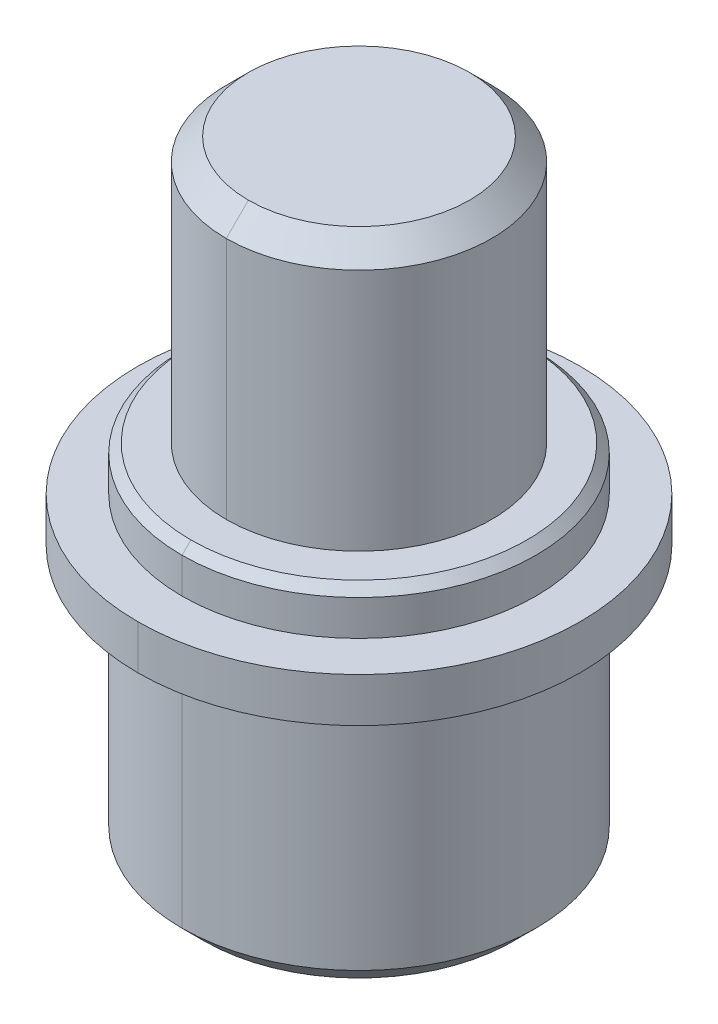
ISO-10303-21;
HEADER;
FILE_DESCRIPTION(('STEP AP214'),'2;1');
FILE_NAME('part.step','',(''),(''),'','','');
FILE_SCHEMA(('AUTOMOTIVE_DESIGN { 1 0 10303 214 1 1 1 1 }'));
ENDSEC;
DATA;
#1=APPLICATION_CONTEXT('core data for automotive mechanical design processes');
#2=APPLICATION_PROTOCOL_DEFINITION('international standard','automotive_design',2000,#1);
#3=PRODUCT_CONTEXT('',#1,'mechanical');
#4=PRODUCT('Part','Part','',(#3));
#5=PRODUCT_RELATED_PRODUCT_CATEGORY('part','',(#4));
#6=PRODUCT_DEFINITION_FORMATION('','',#4);
#7=PRODUCT_DEFINITION_CONTEXT('part definition',#1,'design');
#8=PRODUCT_DEFINITION('design','',#6,#7);
#9=PRODUCT_DEFINITION_SHAPE('','',#8);
#10=(LENGTH_UNIT() NAMED_UNIT(*) SI_UNIT(.MILLI.,.METRE.));
#11=(NAMED_UNIT(*) PLANE_ANGLE_UNIT() SI_UNIT($,.RADIAN.));
#12=(NAMED_UNIT(*) SI_UNIT($,.STERADIAN.) SOLID_ANGLE_UNIT());
#13=UNCERTAINTY_MEASURE_WITH_UNIT(LENGTH_MEASURE(1.E-05),#10,'distance_accuracy_value','');
#14=(GEOMETRIC_REPRESENTATION_CONTEXT(3) GLOBAL_UNCERTAINTY_ASSIGNED_CONTEXT((#13)) GLOBAL_UNIT_ASSIGNED_CONTEXT((#10,
#11,#12)) REPRESENTATION_CONTEXT('',''));
#15=CARTESIAN_POINT('',(0.,0.,0.));
#16=DIRECTION('',(0.,0.,1.));
#17=DIRECTION('',(1.,0.,0.));
#18=AXIS2_PLACEMENT_3D('',#15,#16,#17);
#19=CARTESIAN_POINT('',(0.,8.,0.));
#20=DIRECTION('',(0.,-1.,0.));
#21=DIRECTION('',(0.,0.,-1.));
#22=AXIS2_PLACEMENT_3D('',#19,#20,#21);
#23=CONICAL_SURFACE('',#22,3.8,0.785398163397438);
#24=CARTESIAN_POINT('',(0.,8.,0.));
#25=DIRECTION('',(0.,1.,0.));
#26=DIRECTION('',(0.,0.,1.));
#27=AXIS2_PLACEMENT_3D('',#24,#25,#26);
#28=CIRCLE('',#27,3.8);
#29=CARTESIAN_POINT('',(0.,8.,3.8));
#30=VERTEX_POINT('',#29);
#31=CARTESIAN_POINT('',(0.,8.,-3.8));
#32=VERTEX_POINT('',#31);
#33=EDGE_CURVE('E41',#30,#32,#28,.T.);
#34=ORIENTED_EDGE('',*,*,#33,.F.);
#35=DIRECTION('',(0.,-0.707106781186555,0.70710678118654));
#36=VECTOR('',#35,1.);
#37=CARTESIAN_POINT('',(0.,8.,3.8));
#38=LINE('',#37,#36);
#39=CARTESIAN_POINT('',(0.,7.8,4.));
#40=VERTEX_POINT('',#39);
#41=EDGE_CURVE('E11',#30,#40,#38,.T.);
#42=ORIENTED_EDGE('',*,*,#41,.T.);
#43=CARTESIAN_POINT('',(0.,7.8,0.));
#44=DIRECTION('',(0.,-1.,0.));
#45=DIRECTION('',(0.,0.,1.));
#46=AXIS2_PLACEMENT_3D('',#43,#44,#45);
#47=CIRCLE('',#46,4.);
#48=CARTESIAN_POINT('',(0.,7.8,-4.));
#49=VERTEX_POINT('',#48);
#50=EDGE_CURVE('E132',#49,#40,#47,.T.);
#51=ORIENTED_EDGE('',*,*,#50,.F.);
#52=DIRECTION('',(0.,-0.707106781186555,-0.70710678118654));
#53=VECTOR('',#52,1.);
#54=CARTESIAN_POINT('',(0.,8.,-3.8));
#55=LINE('',#54,#53);
#56=EDGE_CURVE('E176',#32,#49,#55,.T.);
#57=ORIENTED_EDGE('',*,*,#56,.F.);
#58=EDGE_LOOP('',(#34,#42,#51,#57));
#59=FACE_BOUND('',#58,.T.);
#60=ADVANCED_FACE('F16',(#59),#23,.T.);
#61=CARTESIAN_POINT('',(0.,14.,0.));
#62=DIRECTION('',(0.,-1.,0.));
#63=DIRECTION('',(0.,0.,-1.));
#64=AXIS2_PLACEMENT_3D('',#61,#62,#63);
#65=CONICAL_SURFACE('',#64,2.5,0.785398163397445);
#66=CARTESIAN_POINT('',(0.,14.,0.));
#67=DIRECTION('',(0.,1.,0.));
#68=DIRECTION('',(0.,0.,1.));
#69=AXIS2_PLACEMENT_3D('',#66,#67,#68);
#70=CIRCLE('',#69,2.5);
#71=CARTESIAN_POINT('',(0.,14.,2.5));
#72=VERTEX_POINT('',#71);
#73=CARTESIAN_POINT('',(0.,14.,-2.5));
#74=VERTEX_POINT('',#73);
#75=EDGE_CURVE('E224',#72,#74,#70,.T.);
#76=ORIENTED_EDGE('',*,*,#75,.F.);
#77=DIRECTION('',(0.,-0.70710678118655,0.707106781186545));
#78=VECTOR('',#77,1.);
#79=CARTESIAN_POINT('',(0.,14.,2.5));
#80=LINE('',#79,#78);
#81=CARTESIAN_POINT('',(0.,13.5,3.));
#82=VERTEX_POINT('',#81);
#83=EDGE_CURVE('E27',#72,#82,#80,.T.);
#84=ORIENTED_EDGE('',*,*,#83,.T.);
#85=CARTESIAN_POINT('',(0.,13.5,0.));
#86=DIRECTION('',(0.,-1.,0.));
#87=DIRECTION('',(0.,0.,1.));
#88=AXIS2_PLACEMENT_3D('',#85,#86,#87);
#89=CIRCLE('',#88,3.);
#90=CARTESIAN_POINT('',(0.,13.5,-3.));
#91=VERTEX_POINT('',#90);
#92=EDGE_CURVE('E189',#91,#82,#89,.T.);
#93=ORIENTED_EDGE('',*,*,#92,.F.);
#94=DIRECTION('',(0.,-0.70710678118655,-0.707106781186545));
#95=VECTOR('',#94,1.);
#96=CARTESIAN_POINT('',(0.,14.,-2.5));
#97=LINE('',#96,#95);
#98=EDGE_CURVE('E172',#74,#91,#97,.T.);
#99=ORIENTED_EDGE('',*,*,#98,.F.);
#100=EDGE_LOOP('',(#76,#84,#93,#99));
#101=FACE_BOUND('',#100,.T.);
#102=ADVANCED_FACE('F293',(#101),#65,.T.);
#103=CARTESIAN_POINT('',(0.,0.5,0.));
#104=DIRECTION('',(0.,1.,0.));
#105=DIRECTION('',(0.,0.,1.));
#106=AXIS2_PLACEMENT_3D('',#103,#104,#105);
#107=CONICAL_SURFACE('',#106,4.,0.78539816339745);
#108=CARTESIAN_POINT('',(0.,0.,0.));
#109=DIRECTION('',(0.,-1.,0.));
#110=DIRECTION('',(0.,0.,-1.));
#111=AXIS2_PLACEMENT_3D('',#108,#109,#110);
#112=CIRCLE('',#111,3.5);
#113=CARTESIAN_POINT('',(0.,0.,-3.5));
#114=VERTEX_POINT('',#113);
#115=CARTESIAN_POINT('',(0.,0.,3.5));
#116=VERTEX_POINT('',#115);
#117=EDGE_CURVE('E157',#114,#116,#112,.T.);
#118=ORIENTED_EDGE('',*,*,#117,.F.);
#119=DIRECTION('',(0.,0.707106781186546,-0.707106781186549));
#120=VECTOR('',#119,1.);
#121=CARTESIAN_POINT('',(0.,0.5,-4.));
#122=LINE('',#121,#120);
#123=CARTESIAN_POINT('',(0.,0.5,-4.));
#124=VERTEX_POINT('',#123);
#125=EDGE_CURVE('E184',#114,#124,#122,.T.);
#126=ORIENTED_EDGE('',*,*,#125,.T.);
#127=CARTESIAN_POINT('',(0.,0.5,0.));
#128=DIRECTION('',(0.,1.,0.));
#129=DIRECTION('',(0.,0.,-1.));
#130=AXIS2_PLACEMENT_3D('',#127,#128,#129);
#131=CIRCLE('',#130,4.);
#132=CARTESIAN_POINT('',(0.,0.5,4.));
#133=VERTEX_POINT('',#132);
#134=EDGE_CURVE('E187',#133,#124,#131,.T.);
#135=ORIENTED_EDGE('',*,*,#134,.F.);
#136=DIRECTION('',(0.,0.707106781186546,0.707106781186549));
#137=VECTOR('',#136,1.);
#138=CARTESIAN_POINT('',(0.,0.5,4.));
#139=LINE('',#138,#137);
#140=EDGE_CURVE('E170',#116,#133,#139,.T.);
#141=ORIENTED_EDGE('',*,*,#140,.F.);
#142=EDGE_LOOP('',(#118,#126,#135,#141));
#143=FACE_BOUND('',#142,.T.);
#144=ADVANCED_FACE('F316',(#143),#107,.T.);
#145=CARTESIAN_POINT('',(0.,0.,0.));
#146=DIRECTION('',(0.,1.,0.));
#147=DIRECTION('',(0.,0.,1.));
#148=AXIS2_PLACEMENT_3D('',#145,#146,#147);
#149=CYLINDRICAL_SURFACE('',#148,4.);
#150=ORIENTED_EDGE('',*,*,#134,.T.);
#151=DIRECTION('',(0.,1.,0.));
#152=VECTOR('',#151,1.);
#153=CARTESIAN_POINT('',(0.,0.,-4.));
#154=LINE('',#153,#152);
#155=CARTESIAN_POINT('',(0.,6.,-4.));
#156=VERTEX_POINT('',#155);
#157=EDGE_CURVE('E220',#124,#156,#154,.T.);
#158=ORIENTED_EDGE('',*,*,#157,.T.);
#159=CARTESIAN_POINT('',(0.,6.,0.));
#160=DIRECTION('',(0.,1.,0.));
#161=DIRECTION('',(0.,0.,1.));
#162=AXIS2_PLACEMENT_3D('',#159,#160,#161);
#163=CIRCLE('',#162,4.);
#164=CARTESIAN_POINT('',(0.,6.,4.));
#165=VERTEX_POINT('',#164);
#166=EDGE_CURVE('E210',#165,#156,#163,.T.);
#167=ORIENTED_EDGE('',*,*,#166,.F.);
#168=DIRECTION('',(0.,1.,0.));
#169=VECTOR('',#168,1.);
#170=CARTESIAN_POINT('',(0.,0.,4.));
#171=LINE('',#170,#169);
#172=EDGE_CURVE('E169',#133,#165,#171,.T.);
#173=ORIENTED_EDGE('',*,*,#172,.F.);
#174=EDGE_LOOP('',(#150,#158,#167,#173));
#175=FACE_BOUND('',#174,.T.);
#176=ADVANCED_FACE('F18',(#175),#149,.T.);
#177=CARTESIAN_POINT('',(0.,0.,0.));
#178=DIRECTION('',(0.,1.,0.));
#179=DIRECTION('',(0.,0.,1.));
#180=AXIS2_PLACEMENT_3D('',#177,#178,#179);
#181=CYLINDRICAL_SURFACE('',#180,5.);
#182=CARTESIAN_POINT('',(0.,6.,0.));
#183=DIRECTION('',(0.,1.,0.));
#184=DIRECTION('',(0.,0.,1.));
#185=AXIS2_PLACEMENT_3D('',#182,#183,#184);
#186=CIRCLE('',#185,5.);
#187=CARTESIAN_POINT('',(0.,6.,5.));
#188=VERTEX_POINT('',#187);
#189=CARTESIAN_POINT('',(0.,6.,-5.));
#190=VERTEX_POINT('',#189);
#191=EDGE_CURVE('E267',#188,#190,#186,.T.);
#192=ORIENTED_EDGE('',*,*,#191,.T.);
#193=DIRECTION('',(0.,1.,0.));
#194=VECTOR('',#193,1.);
#195=CARTESIAN_POINT('',(0.,0.,-5.));
#196=LINE('',#195,#194);
#197=CARTESIAN_POINT('',(0.,7.,-5.));
#198=VERTEX_POINT('',#197);
#199=EDGE_CURVE('E143',#190,#198,#196,.T.);
#200=ORIENTED_EDGE('',*,*,#199,.T.);
#201=CARTESIAN_POINT('',(0.,7.,0.));
#202=DIRECTION('',(0.,1.,0.));
#203=DIRECTION('',(0.,0.,1.));
#204=AXIS2_PLACEMENT_3D('',#201,#202,#203);
#205=CIRCLE('',#204,5.);
#206=CARTESIAN_POINT('',(0.,7.,5.));
#207=VERTEX_POINT('',#206);
#208=EDGE_CURVE('E163',#207,#198,#205,.T.);
#209=ORIENTED_EDGE('',*,*,#208,.F.);
#210=DIRECTION('',(0.,1.,0.));
#211=VECTOR('',#210,1.);
#212=CARTESIAN_POINT('',(0.,0.,5.));
#213=LINE('',#212,#211);
#214=EDGE_CURVE('E203',#188,#207,#213,.T.);
#215=ORIENTED_EDGE('',*,*,#214,.F.);
#216=EDGE_LOOP('',(#192,#200,#209,#215));
#217=FACE_BOUND('',#216,.T.);
#218=ADVANCED_FACE('F483',(#217),#181,.T.);
#219=CARTESIAN_POINT('',(0.,0.,0.));
#220=DIRECTION('',(0.,1.,0.));
#221=DIRECTION('',(0.,0.,1.));
#222=AXIS2_PLACEMENT_3D('',#219,#220,#221);
#223=CYLINDRICAL_SURFACE('',#222,4.);
#224=CARTESIAN_POINT('',(0.,7.,0.));
#225=DIRECTION('',(0.,1.,0.));
#226=DIRECTION('',(0.,0.,1.));
#227=AXIS2_PLACEMENT_3D('',#224,#225,#226);
#228=CIRCLE('',#227,4.);
#229=CARTESIAN_POINT('',(0.,7.,4.));
#230=VERTEX_POINT('',#229);
#231=CARTESIAN_POINT('',(0.,7.,-4.));
#232=VERTEX_POINT('',#231);
#233=EDGE_CURVE('E129',#230,#232,#228,.T.);
#234=ORIENTED_EDGE('',*,*,#233,.T.);
#235=DIRECTION('',(0.,1.,0.));
#236=VECTOR('',#235,1.);
#237=CARTESIAN_POINT('',(0.,0.,-4.));
#238=LINE('',#237,#236);
#239=EDGE_CURVE('E144',#232,#49,#238,.T.);
#240=ORIENTED_EDGE('',*,*,#239,.T.);
#241=ORIENTED_EDGE('',*,*,#50,.T.);
#242=DIRECTION('',(0.,1.,0.));
#243=VECTOR('',#242,1.);
#244=CARTESIAN_POINT('',(0.,0.,4.));
#245=LINE('',#244,#243);
#246=EDGE_CURVE('E125',#230,#40,#245,.T.);
#247=ORIENTED_EDGE('',*,*,#246,.F.);
#248=EDGE_LOOP('',(#234,#240,#241,#247));
#249=FACE_BOUND('',#248,.T.);
#250=ADVANCED_FACE('F127',(#249),#223,.T.);
#251=CARTESIAN_POINT('',(0.,0.,0.));
#252=DIRECTION('',(0.,1.,0.));
#253=DIRECTION('',(0.,0.,1.));
#254=AXIS2_PLACEMENT_3D('',#251,#252,#253);
#255=CYLINDRICAL_SURFACE('',#254,3.);
#256=CARTESIAN_POINT('',(0.,8.,0.));
#257=DIRECTION('',(0.,1.,0.));
#258=DIRECTION('',(0.,0.,1.));
#259=AXIS2_PLACEMENT_3D('',#256,#257,#258);
#260=CIRCLE('',#259,3.);
#261=CARTESIAN_POINT('',(0.,8.,3.));
#262=VERTEX_POINT('',#261);
#263=CARTESIAN_POINT('',(0.,8.,-3.));
#264=VERTEX_POINT('',#263);
#265=EDGE_CURVE('E195',#262,#264,#260,.T.);
#266=ORIENTED_EDGE('',*,*,#265,.T.);
#267=DIRECTION('',(0.,1.,0.));
#268=VECTOR('',#267,1.);
#269=CARTESIAN_POINT('',(0.,0.,-3.));
#270=LINE('',#269,#268);
#271=EDGE_CURVE('E193',#264,#91,#270,.T.);
#272=ORIENTED_EDGE('',*,*,#271,.T.);
#273=ORIENTED_EDGE('',*,*,#92,.T.);
#274=DIRECTION('',(0.,1.,0.));
#275=VECTOR('',#274,1.);
#276=CARTESIAN_POINT('',(0.,0.,3.));
#277=LINE('',#276,#275);
#278=EDGE_CURVE('E177',#262,#82,#277,.T.);
#279=ORIENTED_EDGE('',*,*,#278,.F.);
#280=EDGE_LOOP('',(#266,#272,#273,#279));
#281=FACE_BOUND('',#280,.T.);
#282=ADVANCED_FACE('F295',(#281),#255,.T.);
#283=CARTESIAN_POINT('',(-4.,0.,0.));
#284=DIRECTION('',(0.,-1.,0.));
#285=DIRECTION('',(0.,0.,-1.));
#286=AXIS2_PLACEMENT_3D('',#283,#284,#285);
#287=PLANE('',#286);
#288=CARTESIAN_POINT('',(0.,0.,0.));
#289=DIRECTION('',(0.,-1.,0.));
#290=DIRECTION('',(0.,0.,-1.));
#291=AXIS2_PLACEMENT_3D('',#288,#289,#290);
#292=CIRCLE('',#291,3.5);
#293=EDGE_CURVE('E194',#116,#114,#292,.T.);
#294=ORIENTED_EDGE('',*,*,#293,.T.);
#295=ORIENTED_EDGE('',*,*,#117,.T.);
#296=EDGE_LOOP('',(#294,#295));
#297=FACE_BOUND('',#296,.T.);
#298=ADVANCED_FACE('F409',(#297),#287,.T.);
#299=CARTESIAN_POINT('',(0.,14.,0.));
#300=DIRECTION('',(0.,1.,0.));
#301=DIRECTION('',(1.,0.,0.));
#302=AXIS2_PLACEMENT_3D('',#299,#300,#301);
#303=PLANE('',#302);
#304=CARTESIAN_POINT('',(0.,14.,0.));
#305=DIRECTION('',(0.,1.,0.));
#306=DIRECTION('',(0.,0.,1.));
#307=AXIS2_PLACEMENT_3D('',#304,#305,#306);
#308=CIRCLE('',#307,2.5);
#309=EDGE_CURVE('E227',#74,#72,#308,.T.);
#310=ORIENTED_EDGE('',*,*,#309,.T.);
#311=ORIENTED_EDGE('',*,*,#75,.T.);
#312=EDGE_LOOP('',(#310,#311));
#313=FACE_BOUND('',#312,.T.);
#314=ADVANCED_FACE('F308',(#313),#303,.T.);
#315=CARTESIAN_POINT('',(0.,0.,0.));
#316=DIRECTION('',(0.,1.,0.));
#317=DIRECTION('',(0.,0.,1.));
#318=AXIS2_PLACEMENT_3D('',#315,#316,#317);
#319=CYLINDRICAL_SURFACE('',#318,3.);
#320=ORIENTED_EDGE('',*,*,#271,.F.);
#321=CARTESIAN_POINT('',(0.,8.,0.));
#322=DIRECTION('',(0.,1.,0.));
#323=DIRECTION('',(0.,0.,1.));
#324=AXIS2_PLACEMENT_3D('',#321,#322,#323);
#325=CIRCLE('',#324,3.);
#326=EDGE_CURVE('E180',#264,#262,#325,.T.);
#327=ORIENTED_EDGE('',*,*,#326,.T.);
#328=ORIENTED_EDGE('',*,*,#278,.T.);
#329=CARTESIAN_POINT('',(0.,13.5,0.));
#330=DIRECTION('',(0.,-1.,0.));
#331=DIRECTION('',(0.,0.,1.));
#332=AXIS2_PLACEMENT_3D('',#329,#330,#331);
#333=CIRCLE('',#332,3.);
#334=EDGE_CURVE('E181',#82,#91,#333,.T.);
#335=ORIENTED_EDGE('',*,*,#334,.T.);
#336=EDGE_LOOP('',(#320,#327,#328,#335));
#337=FACE_BOUND('',#336,.T.);
#338=ADVANCED_FACE('F287',(#337),#319,.T.);
#339=CARTESIAN_POINT('',(-3.,8.,0.));
#340=DIRECTION('',(0.,1.,0.));
#341=DIRECTION('',(1.,0.,0.));
#342=AXIS2_PLACEMENT_3D('',#339,#340,#341);
#343=PLANE('',#342);
#344=CARTESIAN_POINT('',(0.,8.,0.));
#345=DIRECTION('',(0.,1.,0.));
#346=DIRECTION('',(0.,0.,1.));
#347=AXIS2_PLACEMENT_3D('',#344,#345,#346);
#348=CIRCLE('',#347,3.8);
#349=EDGE_CURVE('E153',#32,#30,#348,.T.);
#350=ORIENTED_EDGE('',*,*,#349,.T.);
#351=ORIENTED_EDGE('',*,*,#33,.T.);
#352=EDGE_LOOP('',(#350,#351));
#353=FACE_BOUND('',#352,.T.);
#354=ORIENTED_EDGE('',*,*,#265,.F.);
#355=ORIENTED_EDGE('',*,*,#326,.F.);
#356=EDGE_LOOP('',(#354,#355));
#357=FACE_BOUND('',#356,.T.);
#358=ADVANCED_FACE('F298',(#353,#357),#343,.T.);
#359=CARTESIAN_POINT('',(0.,0.,0.));
#360=DIRECTION('',(0.,1.,0.));
#361=DIRECTION('',(0.,0.,1.));
#362=AXIS2_PLACEMENT_3D('',#359,#360,#361);
#363=CYLINDRICAL_SURFACE('',#362,4.);
#364=ORIENTED_EDGE('',*,*,#239,.F.);
#365=CARTESIAN_POINT('',(0.,7.,0.));
#366=DIRECTION('',(0.,1.,0.));
#367=DIRECTION('',(0.,0.,1.));
#368=AXIS2_PLACEMENT_3D('',#365,#366,#367);
#369=CIRCLE('',#368,4.);
#370=EDGE_CURVE('E137',#232,#230,#369,.T.);
#371=ORIENTED_EDGE('',*,*,#370,.T.);
#372=ORIENTED_EDGE('',*,*,#246,.T.);
#373=CARTESIAN_POINT('',(0.,7.8,0.));
#374=DIRECTION('',(0.,-1.,0.));
#375=DIRECTION('',(0.,0.,1.));
#376=AXIS2_PLACEMENT_3D('',#373,#374,#375);
#377=CIRCLE('',#376,4.);
#378=EDGE_CURVE('E138',#40,#49,#377,.T.);
#379=ORIENTED_EDGE('',*,*,#378,.T.);
#380=EDGE_LOOP('',(#364,#371,#372,#379));
#381=FACE_BOUND('',#380,.T.);
#382=ADVANCED_FACE('F146',(#381),#363,.T.);
#383=CARTESIAN_POINT('',(-4.,7.,0.));
#384=DIRECTION('',(0.,1.,0.));
#385=DIRECTION('',(1.,0.,0.));
#386=AXIS2_PLACEMENT_3D('',#383,#384,#385);
#387=PLANE('',#386);
#388=ORIENTED_EDGE('',*,*,#208,.T.);
#389=CARTESIAN_POINT('',(0.,7.,0.));
#390=DIRECTION('',(0.,1.,0.));
#391=DIRECTION('',(0.,0.,1.));
#392=AXIS2_PLACEMENT_3D('',#389,#390,#391);
#393=CIRCLE('',#392,5.);
#394=EDGE_CURVE('E159',#198,#207,#393,.T.);
#395=ORIENTED_EDGE('',*,*,#394,.T.);
#396=EDGE_LOOP('',(#388,#395));
#397=FACE_BOUND('',#396,.T.);
#398=ORIENTED_EDGE('',*,*,#233,.F.);
#399=ORIENTED_EDGE('',*,*,#370,.F.);
#400=EDGE_LOOP('',(#398,#399));
#401=FACE_BOUND('',#400,.T.);
#402=ADVANCED_FACE('F141',(#397,#401),#387,.T.);
#403=CARTESIAN_POINT('',(0.,0.,0.));
#404=DIRECTION('',(0.,1.,0.));
#405=DIRECTION('',(0.,0.,1.));
#406=AXIS2_PLACEMENT_3D('',#403,#404,#405);
#407=CYLINDRICAL_SURFACE('',#406,5.);
#408=ORIENTED_EDGE('',*,*,#199,.F.);
#409=CARTESIAN_POINT('',(0.,6.,0.));
#410=DIRECTION('',(0.,1.,0.));
#411=DIRECTION('',(0.,0.,1.));
#412=AXIS2_PLACEMENT_3D('',#409,#410,#411);
#413=CIRCLE('',#412,5.);
#414=EDGE_CURVE('E164',#190,#188,#413,.T.);
#415=ORIENTED_EDGE('',*,*,#414,.T.);
#416=ORIENTED_EDGE('',*,*,#214,.T.);
#417=ORIENTED_EDGE('',*,*,#394,.F.);
#418=EDGE_LOOP('',(#408,#415,#416,#417));
#419=FACE_BOUND('',#418,.T.);
#420=ADVANCED_FACE('F331',(#419),#407,.T.);
#421=CARTESIAN_POINT('',(-5.,6.,0.));
#422=DIRECTION('',(0.,-1.,0.));
#423=DIRECTION('',(0.,0.,-1.));
#424=AXIS2_PLACEMENT_3D('',#421,#422,#423);
#425=PLANE('',#424);
#426=ORIENTED_EDGE('',*,*,#191,.F.);
#427=ORIENTED_EDGE('',*,*,#414,.F.);
#428=EDGE_LOOP('',(#426,#427));
#429=FACE_BOUND('',#428,.T.);
#430=ORIENTED_EDGE('',*,*,#166,.T.);
#431=CARTESIAN_POINT('',(0.,6.,0.));
#432=DIRECTION('',(0.,1.,0.));
#433=DIRECTION('',(0.,0.,1.));
#434=AXIS2_PLACEMENT_3D('',#431,#432,#433);
#435=CIRCLE('',#434,4.);
#436=EDGE_CURVE('E20',#156,#165,#435,.T.);
#437=ORIENTED_EDGE('',*,*,#436,.T.);
#438=EDGE_LOOP('',(#430,#437));
#439=FACE_BOUND('',#438,.T.);
#440=ADVANCED_FACE('F323',(#429,#439),#425,.T.);
#441=CARTESIAN_POINT('',(0.,0.,0.));
#442=DIRECTION('',(0.,1.,0.));
#443=DIRECTION('',(0.,0.,1.));
#444=AXIS2_PLACEMENT_3D('',#441,#442,#443);
#445=CYLINDRICAL_SURFACE('',#444,4.);
#446=ORIENTED_EDGE('',*,*,#157,.F.);
#447=CARTESIAN_POINT('',(0.,0.5,0.));
#448=DIRECTION('',(0.,1.,0.));
#449=DIRECTION('',(0.,0.,-1.));
#450=AXIS2_PLACEMENT_3D('',#447,#448,#449);
#451=CIRCLE('',#450,4.);
#452=EDGE_CURVE('E165',#124,#133,#451,.T.);
#453=ORIENTED_EDGE('',*,*,#452,.T.);
#454=ORIENTED_EDGE('',*,*,#172,.T.);
#455=ORIENTED_EDGE('',*,*,#436,.F.);
#456=EDGE_LOOP('',(#446,#453,#454,#455));
#457=FACE_BOUND('',#456,.T.);
#458=ADVANCED_FACE('F320',(#457),#445,.T.);
#459=CARTESIAN_POINT('',(0.,0.5,0.));
#460=DIRECTION('',(0.,1.,0.));
#461=DIRECTION('',(0.,0.,1.));
#462=AXIS2_PLACEMENT_3D('',#459,#460,#461);
#463=CONICAL_SURFACE('',#462,4.,0.78539816339745);
#464=ORIENTED_EDGE('',*,*,#125,.F.);
#465=ORIENTED_EDGE('',*,*,#293,.F.);
#466=ORIENTED_EDGE('',*,*,#140,.T.);
#467=ORIENTED_EDGE('',*,*,#452,.F.);
#468=EDGE_LOOP('',(#464,#465,#466,#467));
#469=FACE_BOUND('',#468,.T.);
#470=ADVANCED_FACE('F322',(#469),#463,.T.);
#471=CARTESIAN_POINT('',(0.,14.,0.));
#472=DIRECTION('',(0.,-1.,0.));
#473=DIRECTION('',(0.,0.,-1.));
#474=AXIS2_PLACEMENT_3D('',#471,#472,#473);
#475=CONICAL_SURFACE('',#474,2.5,0.785398163397445);
#476=ORIENTED_EDGE('',*,*,#83,.F.);
#477=ORIENTED_EDGE('',*,*,#309,.F.);
#478=ORIENTED_EDGE('',*,*,#98,.T.);
#479=ORIENTED_EDGE('',*,*,#334,.F.);
#480=EDGE_LOOP('',(#476,#477,#478,#479));
#481=FACE_BOUND('',#480,.T.);
#482=ADVANCED_FACE('F290',(#481),#475,.T.);
#483=CARTESIAN_POINT('',(0.,8.,0.));
#484=DIRECTION('',(0.,-1.,0.));
#485=DIRECTION('',(0.,0.,-1.));
#486=AXIS2_PLACEMENT_3D('',#483,#484,#485);
#487=CONICAL_SURFACE('',#486,3.8,0.785398163397438);
#488=ORIENTED_EDGE('',*,*,#41,.F.);
#489=ORIENTED_EDGE('',*,*,#349,.F.);
#490=ORIENTED_EDGE('',*,*,#56,.T.);
#491=ORIENTED_EDGE('',*,*,#378,.F.);
#492=EDGE_LOOP('',(#488,#489,#490,#491));
#493=FACE_BOUND('',#492,.T.);
#494=ADVANCED_FACE('F421',(#493),#487,.T.);
#495=CLOSED_SHELL('',(#60,#102,#144,#176,#218,#250,#282,#298,#314,#338,#358,#382,#402,#420,#440,
#458,#470,#482,#494));
#496=MANIFOLD_SOLID_BREP('B1',#495);
#497=ADVANCED_BREP_SHAPE_REPRESENTATION('',(#18,#496),#14);
#498=SHAPE_DEFINITION_REPRESENTATION(#9,#497);
ENDSEC;
END-ISO-10303-21;
